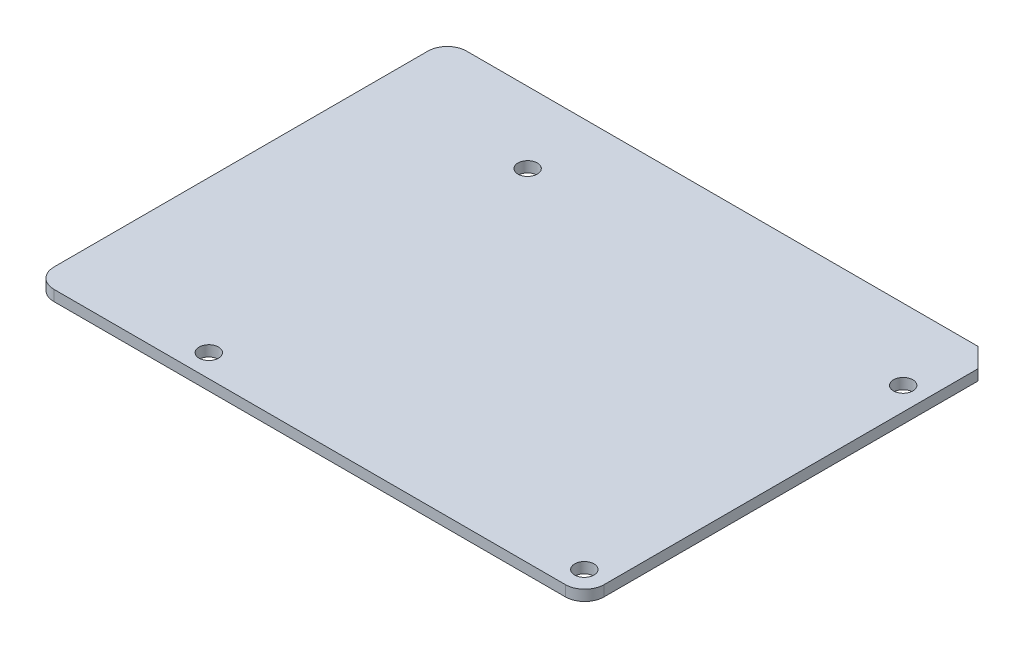
ISO-10303-21;
HEADER;
FILE_DESCRIPTION(('STEP AP214'),'2;1');
FILE_NAME('part.step','',(''),(''),'','','');
FILE_SCHEMA(('AUTOMOTIVE_DESIGN { 1 0 10303 214 1 1 1 1 }'));
ENDSEC;
DATA;
#1=APPLICATION_CONTEXT('core data for automotive mechanical design processes');
#2=APPLICATION_PROTOCOL_DEFINITION('international standard','automotive_design',2000,#1);
#3=PRODUCT_CONTEXT('',#1,'mechanical');
#4=PRODUCT('Part','Part','',(#3));
#5=PRODUCT_RELATED_PRODUCT_CATEGORY('part','',(#4));
#6=PRODUCT_DEFINITION_FORMATION('','',#4);
#7=PRODUCT_DEFINITION_CONTEXT('part definition',#1,'design');
#8=PRODUCT_DEFINITION('design','',#6,#7);
#9=PRODUCT_DEFINITION_SHAPE('','',#8);
#10=(LENGTH_UNIT() NAMED_UNIT(*) SI_UNIT(.MILLI.,.METRE.));
#11=(NAMED_UNIT(*) PLANE_ANGLE_UNIT() SI_UNIT($,.RADIAN.));
#12=(NAMED_UNIT(*) SI_UNIT($,.STERADIAN.) SOLID_ANGLE_UNIT());
#13=UNCERTAINTY_MEASURE_WITH_UNIT(LENGTH_MEASURE(1.E-05),#10,'distance_accuracy_value','');
#14=(GEOMETRIC_REPRESENTATION_CONTEXT(3) GLOBAL_UNCERTAINTY_ASSIGNED_CONTEXT((#13)) GLOBAL_UNIT_ASSIGNED_CONTEXT((#10,
#11,#12)) REPRESENTATION_CONTEXT('',''));
#15=CARTESIAN_POINT('',(0.,0.,0.));
#16=DIRECTION('',(0.,0.,1.));
#17=DIRECTION('',(1.,0.,0.));
#18=AXIS2_PLACEMENT_3D('',#15,#16,#17);
#19=CARTESIAN_POINT('',(0.,0.825,0.));
#20=DIRECTION('',(0.,-1.,0.));
#21=DIRECTION('',(0.,0.,-1.));
#22=AXIS2_PLACEMENT_3D('',#19,#20,#21);
#23=PLANE('',#22);
#24=DIRECTION('',(0.,0.,-1.));
#25=VECTOR('',#24,1.);
#26=CARTESIAN_POINT('',(42.57,0.825,31.93));
#27=LINE('',#26,#25);
#28=CARTESIAN_POINT('',(42.57,0.825,28.93));
#29=VERTEX_POINT('',#28);
#30=CARTESIAN_POINT('',(42.57,0.825,-28.93));
#31=VERTEX_POINT('',#30);
#32=EDGE_CURVE('E130',#29,#31,#27,.T.);
#33=ORIENTED_EDGE('',*,*,#32,.T.);
#34=DIRECTION('',(0.707106781186544,0.,0.707106781186551));
#35=VECTOR('',#34,1.);
#36=CARTESIAN_POINT('',(39.57,0.825,-31.93));
#37=LINE('',#36,#35);
#38=CARTESIAN_POINT('',(39.57,0.825,-31.93));
#39=VERTEX_POINT('',#38);
#40=EDGE_CURVE('E11',#31,#39,#37,.F.);
#41=ORIENTED_EDGE('',*,*,#40,.T.);
#42=DIRECTION('',(-1.,0.,0.));
#43=VECTOR('',#42,1.);
#44=CARTESIAN_POINT('',(-42.57,0.825,-31.93));
#45=LINE('',#44,#43);
#46=CARTESIAN_POINT('',(-39.57,0.825,-31.93));
#47=VERTEX_POINT('',#46);
#48=EDGE_CURVE('E162',#39,#47,#45,.T.);
#49=ORIENTED_EDGE('',*,*,#48,.T.);
#50=CARTESIAN_POINT('',(-39.57,0.825,-28.93));
#51=DIRECTION('',(0.,-1.,0.));
#52=DIRECTION('',(0.,0.,-1.));
#53=AXIS2_PLACEMENT_3D('',#50,#51,#52);
#54=CIRCLE('',#53,3.);
#55=CARTESIAN_POINT('',(-42.57,0.825,-28.93));
#56=VERTEX_POINT('',#55);
#57=EDGE_CURVE('E145',#47,#56,#54,.F.);
#58=ORIENTED_EDGE('',*,*,#57,.T.);
#59=DIRECTION('',(0.,0.,1.));
#60=VECTOR('',#59,1.);
#61=CARTESIAN_POINT('',(-42.57,0.825,31.93));
#62=LINE('',#61,#60);
#63=CARTESIAN_POINT('',(-42.57,0.825,28.93));
#64=VERTEX_POINT('',#63);
#65=EDGE_CURVE('E119',#56,#64,#62,.T.);
#66=ORIENTED_EDGE('',*,*,#65,.T.);
#67=CARTESIAN_POINT('',(-39.57,0.825,28.93));
#68=DIRECTION('',(0.,-1.,0.));
#69=DIRECTION('',(0.,0.,-1.));
#70=AXIS2_PLACEMENT_3D('',#67,#68,#69);
#71=CIRCLE('',#70,3.);
#72=CARTESIAN_POINT('',(-39.57,0.825,31.93));
#73=VERTEX_POINT('',#72);
#74=EDGE_CURVE('E143',#64,#73,#71,.F.);
#75=ORIENTED_EDGE('',*,*,#74,.T.);
#76=DIRECTION('',(1.,0.,0.));
#77=VECTOR('',#76,1.);
#78=CARTESIAN_POINT('',(-42.57,0.825,31.93));
#79=LINE('',#78,#77);
#80=CARTESIAN_POINT('',(39.57,0.825,31.93));
#81=VERTEX_POINT('',#80);
#82=EDGE_CURVE('E136',#73,#81,#79,.T.);
#83=ORIENTED_EDGE('',*,*,#82,.T.);
#84=CARTESIAN_POINT('',(39.57,0.825,28.93));
#85=DIRECTION('',(0.,-1.,0.));
#86=DIRECTION('',(0.,0.,-1.));
#87=AXIS2_PLACEMENT_3D('',#84,#85,#86);
#88=CIRCLE('',#87,3.);
#89=EDGE_CURVE('E141',#81,#29,#88,.F.);
#90=ORIENTED_EDGE('',*,*,#89,.T.);
#91=EDGE_LOOP('',(#33,#41,#49,#58,#66,#75,#83,#90));
#92=FACE_BOUND('',#91,.T.);
#93=CARTESIAN_POINT('',(-19.11,0.825,-20.91));
#94=DIRECTION('',(0.,1.,0.));
#95=DIRECTION('',(0.,0.,1.));
#96=AXIS2_PLACEMENT_3D('',#93,#94,#95);
#97=CIRCLE('',#96,1.5);
#98=CARTESIAN_POINT('',(-19.11,0.825,-19.41));
#99=VERTEX_POINT('',#98);
#100=EDGE_CURVE('E177',#99,#99,#97,.T.);
#101=ORIENTED_EDGE('',*,*,#100,.F.);
#102=EDGE_LOOP('',(#101));
#103=FACE_BOUND('',#102,.T.);
#104=CARTESIAN_POINT('',(39.01,0.825,-20.91));
#105=DIRECTION('',(0.,1.,0.));
#106=DIRECTION('',(0.,0.,1.));
#107=AXIS2_PLACEMENT_3D('',#104,#105,#106);
#108=CIRCLE('',#107,1.5);
#109=CARTESIAN_POINT('',(39.01,0.825,-19.41));
#110=VERTEX_POINT('',#109);
#111=EDGE_CURVE('E182',#110,#110,#108,.T.);
#112=ORIENTED_EDGE('',*,*,#111,.F.);
#113=EDGE_LOOP('',(#112));
#114=FACE_BOUND('',#113,.T.);
#115=CARTESIAN_POINT('',(39.01,0.825,28.43));
#116=DIRECTION('',(0.,1.,0.));
#117=DIRECTION('',(0.,0.,1.));
#118=AXIS2_PLACEMENT_3D('',#115,#116,#117);
#119=CIRCLE('',#118,1.5);
#120=CARTESIAN_POINT('',(39.01,0.825,29.93));
#121=VERTEX_POINT('',#120);
#122=EDGE_CURVE('E187',#121,#121,#119,.T.);
#123=ORIENTED_EDGE('',*,*,#122,.F.);
#124=EDGE_LOOP('',(#123));
#125=FACE_BOUND('',#124,.T.);
#126=CARTESIAN_POINT('',(-19.11,0.825,28.43));
#127=DIRECTION('',(0.,1.,0.));
#128=DIRECTION('',(0.,0.,1.));
#129=AXIS2_PLACEMENT_3D('',#126,#127,#128);
#130=CIRCLE('',#129,1.5);
#131=CARTESIAN_POINT('',(-19.11,0.825,29.93));
#132=VERTEX_POINT('',#131);
#133=EDGE_CURVE('E193',#132,#132,#130,.T.);
#134=ORIENTED_EDGE('',*,*,#133,.F.);
#135=EDGE_LOOP('',(#134));
#136=FACE_BOUND('',#135,.T.);
#137=ADVANCED_FACE('F36',(#92,#103,#114,#125,#136),#23,.F.);
#138=CARTESIAN_POINT('',(0.,-0.825,0.));
#139=DIRECTION('',(0.,-1.,0.));
#140=DIRECTION('',(0.,0.,-1.));
#141=AXIS2_PLACEMENT_3D('',#138,#139,#140);
#142=PLANE('',#141);
#143=CARTESIAN_POINT('',(39.01,-0.825,28.43));
#144=DIRECTION('',(0.,1.,0.));
#145=DIRECTION('',(0.,0.,1.));
#146=AXIS2_PLACEMENT_3D('',#143,#144,#145);
#147=CIRCLE('',#146,1.5);
#148=CARTESIAN_POINT('',(39.01,-0.825,29.93));
#149=VERTEX_POINT('',#148);
#150=EDGE_CURVE('E190',#149,#149,#147,.T.);
#151=ORIENTED_EDGE('',*,*,#150,.T.);
#152=EDGE_LOOP('',(#151));
#153=FACE_BOUND('',#152,.T.);
#154=CARTESIAN_POINT('',(-19.11,-0.825,-20.91));
#155=DIRECTION('',(0.,1.,0.));
#156=DIRECTION('',(0.,0.,1.));
#157=AXIS2_PLACEMENT_3D('',#154,#155,#156);
#158=CIRCLE('',#157,1.5);
#159=CARTESIAN_POINT('',(-19.11,-0.825,-19.41));
#160=VERTEX_POINT('',#159);
#161=EDGE_CURVE('E173',#160,#160,#158,.T.);
#162=ORIENTED_EDGE('',*,*,#161,.T.);
#163=EDGE_LOOP('',(#162));
#164=FACE_BOUND('',#163,.T.);
#165=DIRECTION('',(-1.,0.,0.));
#166=VECTOR('',#165,1.);
#167=CARTESIAN_POINT('',(-42.57,-0.825,-31.93));
#168=LINE('',#167,#166);
#169=CARTESIAN_POINT('',(39.57,-0.825,-31.93));
#170=VERTEX_POINT('',#169);
#171=CARTESIAN_POINT('',(-39.57,-0.825,-31.93));
#172=VERTEX_POINT('',#171);
#173=EDGE_CURVE('E127',#170,#172,#168,.T.);
#174=ORIENTED_EDGE('',*,*,#173,.F.);
#175=DIRECTION('',(-0.707106781186544,0.,-0.707106781186551));
#176=VECTOR('',#175,1.);
#177=CARTESIAN_POINT('',(35.7500000000002,-0.825,-35.7499999999999));
#178=LINE('',#177,#176);
#179=CARTESIAN_POINT('',(42.57,-0.825,-28.93));
#180=VERTEX_POINT('',#179);
#181=EDGE_CURVE('E58',#170,#180,#178,.F.);
#182=ORIENTED_EDGE('',*,*,#181,.T.);
#183=DIRECTION('',(0.,0.,-1.));
#184=VECTOR('',#183,1.);
#185=CARTESIAN_POINT('',(42.57,-0.825,31.93));
#186=LINE('',#185,#184);
#187=CARTESIAN_POINT('',(42.57,-0.825,28.93));
#188=VERTEX_POINT('',#187);
#189=EDGE_CURVE('E132',#188,#180,#186,.T.);
#190=ORIENTED_EDGE('',*,*,#189,.F.);
#191=CARTESIAN_POINT('',(39.57,-0.825,28.93));
#192=DIRECTION('',(0.,-1.,0.));
#193=DIRECTION('',(0.,0.,-1.));
#194=AXIS2_PLACEMENT_3D('',#191,#192,#193);
#195=CIRCLE('',#194,3.);
#196=CARTESIAN_POINT('',(39.57,-0.825,31.93));
#197=VERTEX_POINT('',#196);
#198=EDGE_CURVE('E120',#188,#197,#195,.T.);
#199=ORIENTED_EDGE('',*,*,#198,.T.);
#200=DIRECTION('',(1.,0.,0.));
#201=VECTOR('',#200,1.);
#202=CARTESIAN_POINT('',(-42.57,-0.825,31.93));
#203=LINE('',#202,#201);
#204=CARTESIAN_POINT('',(-39.57,-0.825,31.93));
#205=VERTEX_POINT('',#204);
#206=EDGE_CURVE('E126',#205,#197,#203,.T.);
#207=ORIENTED_EDGE('',*,*,#206,.F.);
#208=CARTESIAN_POINT('',(-39.57,-0.825,28.93));
#209=DIRECTION('',(0.,-1.,0.));
#210=DIRECTION('',(0.,0.,-1.));
#211=AXIS2_PLACEMENT_3D('',#208,#209,#210);
#212=CIRCLE('',#211,3.);
#213=CARTESIAN_POINT('',(-42.57,-0.825,28.93));
#214=VERTEX_POINT('',#213);
#215=EDGE_CURVE('E110',#205,#214,#212,.T.);
#216=ORIENTED_EDGE('',*,*,#215,.T.);
#217=DIRECTION('',(0.,0.,1.));
#218=VECTOR('',#217,1.);
#219=CARTESIAN_POINT('',(-42.57,-0.825,31.93));
#220=LINE('',#219,#218);
#221=CARTESIAN_POINT('',(-42.57,-0.825,-28.93));
#222=VERTEX_POINT('',#221);
#223=EDGE_CURVE('E116',#222,#214,#220,.T.);
#224=ORIENTED_EDGE('',*,*,#223,.F.);
#225=CARTESIAN_POINT('',(-39.57,-0.825,-28.93));
#226=DIRECTION('',(0.,-1.,0.));
#227=DIRECTION('',(0.,0.,-1.));
#228=AXIS2_PLACEMENT_3D('',#225,#226,#227);
#229=CIRCLE('',#228,3.);
#230=EDGE_CURVE('E102',#222,#172,#229,.T.);
#231=ORIENTED_EDGE('',*,*,#230,.T.);
#232=EDGE_LOOP('',(#174,#182,#190,#199,#207,#216,#224,#231));
#233=FACE_BOUND('',#232,.T.);
#234=CARTESIAN_POINT('',(39.01,-0.825,-20.91));
#235=DIRECTION('',(0.,1.,0.));
#236=DIRECTION('',(0.,0.,1.));
#237=AXIS2_PLACEMENT_3D('',#234,#235,#236);
#238=CIRCLE('',#237,1.5);
#239=CARTESIAN_POINT('',(39.01,-0.825,-19.41));
#240=VERTEX_POINT('',#239);
#241=EDGE_CURVE('E184',#240,#240,#238,.T.);
#242=ORIENTED_EDGE('',*,*,#241,.T.);
#243=EDGE_LOOP('',(#242));
#244=FACE_BOUND('',#243,.T.);
#245=CARTESIAN_POINT('',(-19.11,-0.825,28.43));
#246=DIRECTION('',(0.,1.,0.));
#247=DIRECTION('',(0.,0.,1.));
#248=AXIS2_PLACEMENT_3D('',#245,#246,#247);
#249=CIRCLE('',#248,1.5);
#250=CARTESIAN_POINT('',(-19.11,-0.825,29.93));
#251=VERTEX_POINT('',#250);
#252=EDGE_CURVE('E196',#251,#251,#249,.T.);
#253=ORIENTED_EDGE('',*,*,#252,.T.);
#254=EDGE_LOOP('',(#253));
#255=FACE_BOUND('',#254,.T.);
#256=ADVANCED_FACE('F123',(#153,#164,#233,#244,#255),#142,.T.);
#257=CARTESIAN_POINT('',(42.57,0.825,31.93));
#258=DIRECTION('',(-1.,0.,0.));
#259=DIRECTION('',(0.,0.,1.));
#260=AXIS2_PLACEMENT_3D('',#257,#258,#259);
#261=PLANE('',#260);
#262=ORIENTED_EDGE('',*,*,#189,.T.);
#263=DIRECTION('',(0.,1.,0.));
#264=VECTOR('',#263,1.);
#265=CARTESIAN_POINT('',(42.57,0.825,-28.93));
#266=LINE('',#265,#264);
#267=EDGE_CURVE('E44',#180,#31,#266,.T.);
#268=ORIENTED_EDGE('',*,*,#267,.T.);
#269=ORIENTED_EDGE('',*,*,#32,.F.);
#270=DIRECTION('',(0.,-1.,0.));
#271=VECTOR('',#270,1.);
#272=CARTESIAN_POINT('',(42.57,0.825,28.93));
#273=LINE('',#272,#271);
#274=EDGE_CURVE('E152',#29,#188,#273,.T.);
#275=ORIENTED_EDGE('',*,*,#274,.T.);
#276=EDGE_LOOP('',(#262,#268,#269,#275));
#277=FACE_BOUND('',#276,.T.);
#278=ADVANCED_FACE('F210',(#277),#261,.F.);
#279=CARTESIAN_POINT('',(-42.57,0.825,-31.93));
#280=DIRECTION('',(0.,0.,1.));
#281=DIRECTION('',(1.,0.,0.));
#282=AXIS2_PLACEMENT_3D('',#279,#280,#281);
#283=PLANE('',#282);
#284=ORIENTED_EDGE('',*,*,#48,.F.);
#285=DIRECTION('',(0.,-1.,0.));
#286=VECTOR('',#285,1.);
#287=CARTESIAN_POINT('',(39.57,0.825,-31.93));
#288=LINE('',#287,#286);
#289=EDGE_CURVE('E155',#39,#170,#288,.T.);
#290=ORIENTED_EDGE('',*,*,#289,.T.);
#291=ORIENTED_EDGE('',*,*,#173,.T.);
#292=DIRECTION('',(0.,-1.,0.));
#293=VECTOR('',#292,1.);
#294=CARTESIAN_POINT('',(-39.57,0.825,-31.93));
#295=LINE('',#294,#293);
#296=EDGE_CURVE('E108',#172,#47,#295,.F.);
#297=ORIENTED_EDGE('',*,*,#296,.T.);
#298=EDGE_LOOP('',(#284,#290,#291,#297));
#299=FACE_BOUND('',#298,.T.);
#300=ADVANCED_FACE('F161',(#299),#283,.F.);
#301=CARTESIAN_POINT('',(-42.57,0.825,31.93));
#302=DIRECTION('',(1.,0.,0.));
#303=DIRECTION('',(0.,0.,-1.));
#304=AXIS2_PLACEMENT_3D('',#301,#302,#303);
#305=PLANE('',#304);
#306=ORIENTED_EDGE('',*,*,#65,.F.);
#307=DIRECTION('',(0.,-1.,0.));
#308=VECTOR('',#307,1.);
#309=CARTESIAN_POINT('',(-42.57,0.825,-28.93));
#310=LINE('',#309,#308);
#311=EDGE_CURVE('E106',#56,#222,#310,.T.);
#312=ORIENTED_EDGE('',*,*,#311,.T.);
#313=ORIENTED_EDGE('',*,*,#223,.T.);
#314=DIRECTION('',(0.,-1.,0.));
#315=VECTOR('',#314,1.);
#316=CARTESIAN_POINT('',(-42.57,0.825,28.93));
#317=LINE('',#316,#315);
#318=EDGE_CURVE('E121',#214,#64,#317,.F.);
#319=ORIENTED_EDGE('',*,*,#318,.T.);
#320=EDGE_LOOP('',(#306,#312,#313,#319));
#321=FACE_BOUND('',#320,.T.);
#322=ADVANCED_FACE('F115',(#321),#305,.F.);
#323=CARTESIAN_POINT('',(-42.57,0.825,31.93));
#324=DIRECTION('',(0.,0.,-1.));
#325=DIRECTION('',(-1.,0.,0.));
#326=AXIS2_PLACEMENT_3D('',#323,#324,#325);
#327=PLANE('',#326);
#328=ORIENTED_EDGE('',*,*,#82,.F.);
#329=DIRECTION('',(0.,-1.,0.));
#330=VECTOR('',#329,1.);
#331=CARTESIAN_POINT('',(-39.57,0.825,31.93));
#332=LINE('',#331,#330);
#333=EDGE_CURVE('E149',#73,#205,#332,.T.);
#334=ORIENTED_EDGE('',*,*,#333,.T.);
#335=ORIENTED_EDGE('',*,*,#206,.T.);
#336=DIRECTION('',(0.,-1.,0.));
#337=VECTOR('',#336,1.);
#338=CARTESIAN_POINT('',(39.57,0.825,31.93));
#339=LINE('',#338,#337);
#340=EDGE_CURVE('E147',#197,#81,#339,.F.);
#341=ORIENTED_EDGE('',*,*,#340,.T.);
#342=EDGE_LOOP('',(#328,#334,#335,#341));
#343=FACE_BOUND('',#342,.T.);
#344=ADVANCED_FACE('F217',(#343),#327,.F.);
#345=CARTESIAN_POINT('',(-19.11,0.825,-20.91));
#346=DIRECTION('',(0.,-1.,0.));
#347=DIRECTION('',(0.,0.,-1.));
#348=AXIS2_PLACEMENT_3D('',#345,#346,#347);
#349=CYLINDRICAL_SURFACE('',#348,1.5);
#350=ORIENTED_EDGE('',*,*,#100,.T.);
#351=EDGE_LOOP('',(#350));
#352=FACE_BOUND('',#351,.T.);
#353=ORIENTED_EDGE('',*,*,#161,.F.);
#354=EDGE_LOOP('',(#353));
#355=FACE_BOUND('',#354,.T.);
#356=ADVANCED_FACE('F214',(#352,#355),#349,.F.);
#357=CARTESIAN_POINT('',(39.01,0.825,-20.91));
#358=DIRECTION('',(0.,-1.,0.));
#359=DIRECTION('',(0.,0.,-1.));
#360=AXIS2_PLACEMENT_3D('',#357,#358,#359);
#361=CYLINDRICAL_SURFACE('',#360,1.5);
#362=ORIENTED_EDGE('',*,*,#111,.T.);
#363=EDGE_LOOP('',(#362));
#364=FACE_BOUND('',#363,.T.);
#365=ORIENTED_EDGE('',*,*,#241,.F.);
#366=EDGE_LOOP('',(#365));
#367=FACE_BOUND('',#366,.T.);
#368=ADVANCED_FACE('F314',(#364,#367),#361,.F.);
#369=CARTESIAN_POINT('',(39.01,0.825,28.43));
#370=DIRECTION('',(0.,-1.,0.));
#371=DIRECTION('',(0.,0.,-1.));
#372=AXIS2_PLACEMENT_3D('',#369,#370,#371);
#373=CYLINDRICAL_SURFACE('',#372,1.5);
#374=ORIENTED_EDGE('',*,*,#122,.T.);
#375=EDGE_LOOP('',(#374));
#376=FACE_BOUND('',#375,.T.);
#377=ORIENTED_EDGE('',*,*,#150,.F.);
#378=EDGE_LOOP('',(#377));
#379=FACE_BOUND('',#378,.T.);
#380=ADVANCED_FACE('F305',(#376,#379),#373,.F.);
#381=CARTESIAN_POINT('',(-19.11,0.825,28.43));
#382=DIRECTION('',(0.,-1.,0.));
#383=DIRECTION('',(0.,0.,-1.));
#384=AXIS2_PLACEMENT_3D('',#381,#382,#383);
#385=CYLINDRICAL_SURFACE('',#384,1.5);
#386=ORIENTED_EDGE('',*,*,#133,.T.);
#387=EDGE_LOOP('',(#386));
#388=FACE_BOUND('',#387,.T.);
#389=ORIENTED_EDGE('',*,*,#252,.F.);
#390=EDGE_LOOP('',(#389));
#391=FACE_BOUND('',#390,.T.);
#392=ADVANCED_FACE('F202',(#388,#391),#385,.F.);
#393=CARTESIAN_POINT('',(-39.57,0.825,-28.93));
#394=DIRECTION('',(0.,-1.,0.));
#395=DIRECTION('',(0.,0.,-1.));
#396=AXIS2_PLACEMENT_3D('',#393,#394,#395);
#397=CYLINDRICAL_SURFACE('',#396,3.);
#398=ORIENTED_EDGE('',*,*,#57,.F.);
#399=ORIENTED_EDGE('',*,*,#296,.F.);
#400=ORIENTED_EDGE('',*,*,#230,.F.);
#401=ORIENTED_EDGE('',*,*,#311,.F.);
#402=EDGE_LOOP('',(#398,#399,#400,#401));
#403=FACE_BOUND('',#402,.T.);
#404=ADVANCED_FACE('F105',(#403),#397,.T.);
#405=CARTESIAN_POINT('',(-39.57,0.825,28.93));
#406=DIRECTION('',(0.,-1.,0.));
#407=DIRECTION('',(0.,0.,-1.));
#408=AXIS2_PLACEMENT_3D('',#405,#406,#407);
#409=CYLINDRICAL_SURFACE('',#408,3.);
#410=ORIENTED_EDGE('',*,*,#74,.F.);
#411=ORIENTED_EDGE('',*,*,#318,.F.);
#412=ORIENTED_EDGE('',*,*,#215,.F.);
#413=ORIENTED_EDGE('',*,*,#333,.F.);
#414=EDGE_LOOP('',(#410,#411,#412,#413));
#415=FACE_BOUND('',#414,.T.);
#416=ADVANCED_FACE('F229',(#415),#409,.T.);
#417=CARTESIAN_POINT('',(39.57,0.825,28.93));
#418=DIRECTION('',(0.,-1.,0.));
#419=DIRECTION('',(0.,0.,-1.));
#420=AXIS2_PLACEMENT_3D('',#417,#418,#419);
#421=CYLINDRICAL_SURFACE('',#420,3.);
#422=ORIENTED_EDGE('',*,*,#89,.F.);
#423=ORIENTED_EDGE('',*,*,#340,.F.);
#424=ORIENTED_EDGE('',*,*,#198,.F.);
#425=ORIENTED_EDGE('',*,*,#274,.F.);
#426=EDGE_LOOP('',(#422,#423,#424,#425));
#427=FACE_BOUND('',#426,.T.);
#428=ADVANCED_FACE('F231',(#427),#421,.T.);
#429=CARTESIAN_POINT('',(39.57,0.825,-31.93));
#430=DIRECTION('',(-0.707106781186551,0.,0.707106781186544));
#431=DIRECTION('',(0.,-1.,0.));
#432=AXIS2_PLACEMENT_3D('',#429,#430,#431);
#433=PLANE('',#432);
#434=ORIENTED_EDGE('',*,*,#40,.F.);
#435=ORIENTED_EDGE('',*,*,#267,.F.);
#436=ORIENTED_EDGE('',*,*,#181,.F.);
#437=ORIENTED_EDGE('',*,*,#289,.F.);
#438=EDGE_LOOP('',(#434,#435,#436,#437));
#439=FACE_BOUND('',#438,.T.);
#440=ADVANCED_FACE('F38',(#439),#433,.F.);
#441=CLOSED_SHELL('',(#137,#256,#278,#300,#322,#344,#356,#368,#380,#392,#404,#416,#428,#440));
#442=MANIFOLD_SOLID_BREP('B2',#441);
#443=ADVANCED_BREP_SHAPE_REPRESENTATION('',(#18,#442),#14);
#444=SHAPE_DEFINITION_REPRESENTATION(#9,#443);
ENDSEC;
END-ISO-10303-21;
